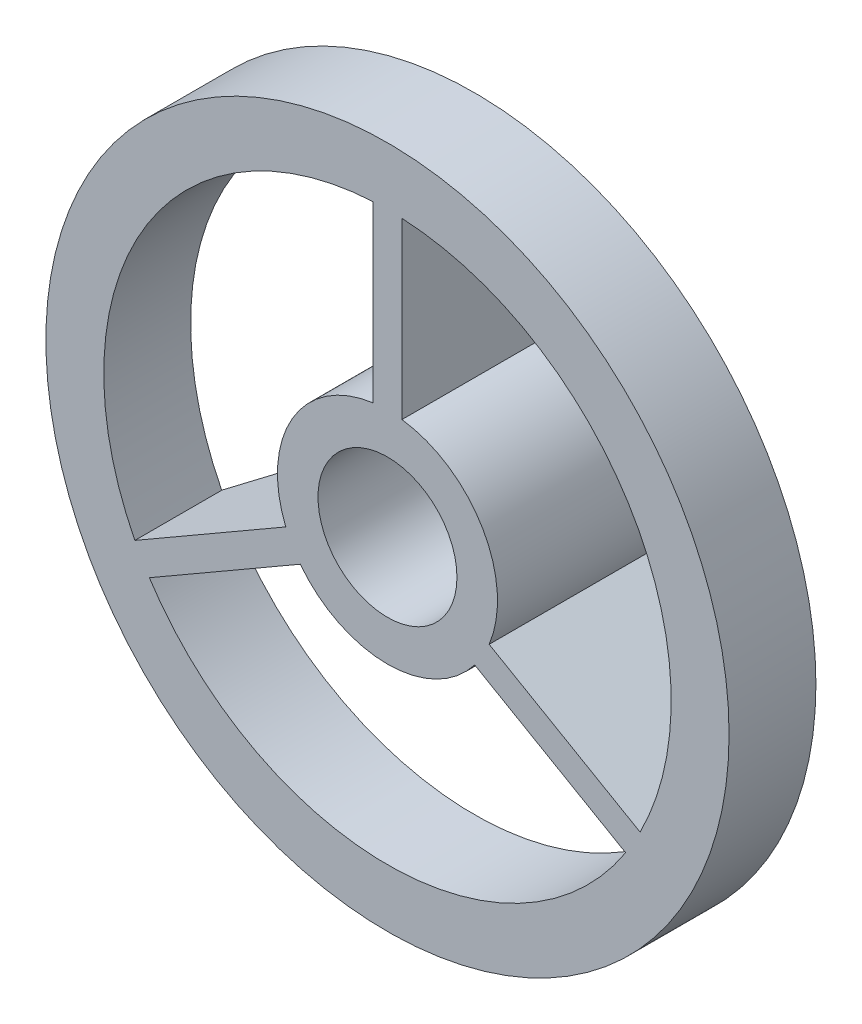
ISO-10303-21;
HEADER;
FILE_DESCRIPTION(('STEP AP214'),'2;1');
FILE_NAME('part.step','',(''),(''),'','','');
FILE_SCHEMA(('AUTOMOTIVE_DESIGN { 1 0 10303 214 1 1 1 1 }'));
ENDSEC;
DATA;
#1=APPLICATION_CONTEXT('core data for automotive mechanical design processes');
#2=APPLICATION_PROTOCOL_DEFINITION('international standard','automotive_design',2000,#1);
#3=PRODUCT_CONTEXT('',#1,'mechanical');
#4=PRODUCT('Part','Part','',(#3));
#5=PRODUCT_RELATED_PRODUCT_CATEGORY('part','',(#4));
#6=PRODUCT_DEFINITION_FORMATION('','',#4);
#7=PRODUCT_DEFINITION_CONTEXT('part definition',#1,'design');
#8=PRODUCT_DEFINITION('design','',#6,#7);
#9=PRODUCT_DEFINITION_SHAPE('','',#8);
#10=(LENGTH_UNIT() NAMED_UNIT(*) SI_UNIT(.MILLI.,.METRE.));
#11=(NAMED_UNIT(*) PLANE_ANGLE_UNIT() SI_UNIT($,.RADIAN.));
#12=(NAMED_UNIT(*) SI_UNIT($,.STERADIAN.) SOLID_ANGLE_UNIT());
#13=UNCERTAINTY_MEASURE_WITH_UNIT(LENGTH_MEASURE(1.E-05),#10,'distance_accuracy_value','');
#14=(GEOMETRIC_REPRESENTATION_CONTEXT(3) GLOBAL_UNCERTAINTY_ASSIGNED_CONTEXT((#13)) GLOBAL_UNIT_ASSIGNED_CONTEXT((#10,
#11,#12)) REPRESENTATION_CONTEXT('',''));
#15=CARTESIAN_POINT('',(0.,0.,0.));
#16=DIRECTION('',(0.,0.,1.));
#17=DIRECTION('',(1.,0.,0.));
#18=AXIS2_PLACEMENT_3D('',#15,#16,#17);
#19=CARTESIAN_POINT('',(0.,0.,3.5));
#20=DIRECTION('',(0.,0.,-1.));
#21=DIRECTION('',(-1.,0.,0.));
#22=AXIS2_PLACEMENT_3D('',#19,#20,#21);
#23=CYLINDRICAL_SURFACE('',#22,1.9);
#24=DIRECTION('',(0.,0.,-1.));
#25=VECTOR('',#24,1.);
#26=CARTESIAN_POINT('',(1.75614223781987,-0.725234059145742,3.5));
#27=LINE('',#26,#25);
#28=CARTESIAN_POINT('',(1.75614223781987,-0.725234059145742,0.));
#29=VERTEX_POINT('',#28);
#30=CARTESIAN_POINT('',(1.75614223781987,-0.725234059145742,3.5));
#31=VERTEX_POINT('',#30);
#32=EDGE_CURVE('E196',#29,#31,#27,.F.);
#33=ORIENTED_EDGE('',*,*,#32,.F.);
#34=CARTESIAN_POINT('',(0.,0.,0.));
#35=DIRECTION('',(0.,0.,1.));
#36=DIRECTION('',(1.,0.,0.));
#37=AXIS2_PLACEMENT_3D('',#34,#35,#36);
#38=CIRCLE('',#37,1.9);
#39=CARTESIAN_POINT('',(0.25,1.88348082018374,0.));
#40=VERTEX_POINT('',#39);
#41=EDGE_CURVE('E287',#29,#40,#38,.T.);
#42=ORIENTED_EDGE('',*,*,#41,.T.);
#43=DIRECTION('',(0.,0.,-1.));
#44=VECTOR('',#43,1.);
#45=CARTESIAN_POINT('',(0.25,1.88348082018374,3.5));
#46=LINE('',#45,#44);
#47=CARTESIAN_POINT('',(0.25,1.88348082018374,3.5));
#48=VERTEX_POINT('',#47);
#49=EDGE_CURVE('E301',#40,#48,#46,.F.);
#50=ORIENTED_EDGE('',*,*,#49,.T.);
#51=CARTESIAN_POINT('',(0.,0.,3.5));
#52=DIRECTION('',(0.,0.,1.));
#53=DIRECTION('',(1.,0.,0.));
#54=AXIS2_PLACEMENT_3D('',#51,#52,#53);
#55=CIRCLE('',#54,1.9);
#56=EDGE_CURVE('E295',#31,#48,#55,.T.);
#57=ORIENTED_EDGE('',*,*,#56,.F.);
#58=EDGE_LOOP('',(#33,#42,#50,#57));
#59=FACE_BOUND('',#58,.T.);
#60=ADVANCED_FACE('F35',(#59),#23,.T.);
#61=CARTESIAN_POINT('',(0.,0.,2.));
#62=DIRECTION('',(0.,0.,1.));
#63=DIRECTION('',(1.,0.,0.));
#64=AXIS2_PLACEMENT_3D('',#61,#62,#63);
#65=PLANE('',#64);
#66=CARTESIAN_POINT('',(0.,0.,2.));
#67=DIRECTION('',(0.,0.,1.));
#68=DIRECTION('',(1.,0.,0.));
#69=AXIS2_PLACEMENT_3D('',#66,#67,#68);
#70=CIRCLE('',#69,5.9);
#71=CARTESIAN_POINT('',(5.9,0.,2.));
#72=VERTEX_POINT('',#71);
#73=EDGE_CURVE('E247',#72,#72,#70,.T.);
#74=ORIENTED_EDGE('',*,*,#73,.F.);
#75=EDGE_LOOP('',(#74));
#76=FACE_BOUND('',#75,.T.);
#77=CARTESIAN_POINT('',(0.,0.,2.));
#78=DIRECTION('',(0.,0.,1.));
#79=DIRECTION('',(1.,0.,0.));
#80=AXIS2_PLACEMENT_3D('',#77,#78,#79);
#81=CIRCLE('',#80,4.9);
#82=CARTESIAN_POINT('',(-4.11299775837599,-2.66331549756954,2.));
#83=VERTEX_POINT('',#82);
#84=CARTESIAN_POINT('',(4.11299775837602,-2.66331549756949,2.));
#85=VERTEX_POINT('',#84);
#86=EDGE_CURVE('E242',#83,#85,#81,.T.);
#87=ORIENTED_EDGE('',*,*,#86,.T.);
#88=DIRECTION('',(0.866025403784443,-0.499999999999992,0.));
#89=VECTOR('',#88,1.);
#90=CARTESIAN_POINT('',(-0.124999999999998,-0.216506350946111,2.));
#91=LINE('',#90,#89);
#92=CARTESIAN_POINT('',(4.11852447854377,-2.66650635094607,2.));
#93=VERTEX_POINT('',#92);
#94=EDGE_CURVE('E201',#85,#93,#91,.T.);
#95=ORIENTED_EDGE('',*,*,#94,.T.);
#96=DIRECTION('',(0.499999999999992,0.866025403784443,0.));
#97=VECTOR('',#96,1.);
#98=CARTESIAN_POINT('',(4.11852447854377,-2.66650635094607,2.));
#99=LINE('',#98,#97);
#100=CARTESIAN_POINT('',(4.36852447854377,-2.23349364905385,2.));
#101=VERTEX_POINT('',#100);
#102=EDGE_CURVE('E50',#93,#101,#99,.T.);
#103=ORIENTED_EDGE('',*,*,#102,.T.);
#104=DIRECTION('',(0.866025403784443,-0.499999999999992,0.));
#105=VECTOR('',#104,1.);
#106=CARTESIAN_POINT('',(0.124999999999998,0.216506350946111,2.));
#107=LINE('',#106,#105);
#108=CARTESIAN_POINT('',(4.36299775837602,-2.23030279567726,2.));
#109=VERTEX_POINT('',#108);
#110=EDGE_CURVE('E194',#109,#101,#107,.T.);
#111=ORIENTED_EDGE('',*,*,#110,.F.);
#112=CARTESIAN_POINT('',(0.25,4.89361829324683,2.));
#113=VERTEX_POINT('',#112);
#114=EDGE_CURVE('E243',#109,#113,#81,.T.);
#115=ORIENTED_EDGE('',*,*,#114,.T.);
#116=DIRECTION('',(0.,-1.,0.));
#117=VECTOR('',#116,1.);
#118=CARTESIAN_POINT('',(0.25,0.,2.));
#119=LINE('',#118,#117);
#120=CARTESIAN_POINT('',(0.25,4.9,2.));
#121=VERTEX_POINT('',#120);
#122=EDGE_CURVE('E257',#121,#113,#119,.T.);
#123=ORIENTED_EDGE('',*,*,#122,.F.);
#124=DIRECTION('',(-1.,0.,0.));
#125=VECTOR('',#124,1.);
#126=CARTESIAN_POINT('',(0.25,4.9,2.));
#127=LINE('',#126,#125);
#128=CARTESIAN_POINT('',(-0.25,4.9,2.));
#129=VERTEX_POINT('',#128);
#130=EDGE_CURVE('E273',#121,#129,#127,.T.);
#131=ORIENTED_EDGE('',*,*,#130,.T.);
#132=DIRECTION('',(0.,-1.,0.));
#133=VECTOR('',#132,1.);
#134=CARTESIAN_POINT('',(-0.25,0.,2.));
#135=LINE('',#134,#133);
#136=CARTESIAN_POINT('',(-0.25,4.89361829324683,2.));
#137=VERTEX_POINT('',#136);
#138=EDGE_CURVE('E260',#129,#137,#135,.T.);
#139=ORIENTED_EDGE('',*,*,#138,.T.);
#140=CARTESIAN_POINT('',(-4.36299775837599,-2.23030279567732,2.));
#141=VERTEX_POINT('',#140);
#142=EDGE_CURVE('E238',#137,#141,#81,.T.);
#143=ORIENTED_EDGE('',*,*,#142,.T.);
#144=DIRECTION('',(-0.866025403784436,-0.500000000000004,0.));
#145=VECTOR('',#144,1.);
#146=CARTESIAN_POINT('',(-0.125000000000001,0.216506350946109,2.));
#147=LINE('',#146,#145);
#148=CARTESIAN_POINT('',(-4.36852447854374,-2.23349364905391,2.));
#149=VERTEX_POINT('',#148);
#150=EDGE_CURVE('E232',#141,#149,#147,.T.);
#151=ORIENTED_EDGE('',*,*,#150,.T.);
#152=DIRECTION('',(0.500000000000004,-0.866025403784436,0.));
#153=VECTOR('',#152,1.);
#154=CARTESIAN_POINT('',(-4.36852447854374,-2.23349364905391,2.));
#155=LINE('',#154,#153);
#156=CARTESIAN_POINT('',(-4.11852447854374,-2.66650635094613,2.));
#157=VERTEX_POINT('',#156);
#158=EDGE_CURVE('E215',#149,#157,#155,.T.);
#159=ORIENTED_EDGE('',*,*,#158,.T.);
#160=DIRECTION('',(-0.866025403784436,-0.500000000000004,0.));
#161=VECTOR('',#160,1.);
#162=CARTESIAN_POINT('',(0.125000000000001,-0.216506350946109,2.));
#163=LINE('',#162,#161);
#164=EDGE_CURVE('E226',#83,#157,#163,.T.);
#165=ORIENTED_EDGE('',*,*,#164,.F.);
#166=EDGE_LOOP('',(#87,#95,#103,#111,#115,#123,#131,#139,#143,#151,#159,#165));
#167=FACE_BOUND('',#166,.T.);
#168=ADVANCED_FACE('F331',(#76,#167),#65,.F.);
#169=CARTESIAN_POINT('',(0.,0.,2.));
#170=DIRECTION('',(0.,0.,1.));
#171=DIRECTION('',(1.,0.,0.));
#172=AXIS2_PLACEMENT_3D('',#169,#170,#171);
#173=CYLINDRICAL_SURFACE('',#172,4.9);
#174=DIRECTION('',(0.,0.,1.));
#175=VECTOR('',#174,1.);
#176=CARTESIAN_POINT('',(4.36299775837602,-2.23030279567726,2.));
#177=LINE('',#176,#175);
#178=CARTESIAN_POINT('',(4.36299775837602,-2.23030279567726,3.5));
#179=VERTEX_POINT('',#178);
#180=EDGE_CURVE('E169',#179,#109,#177,.F.);
#181=ORIENTED_EDGE('',*,*,#180,.F.);
#182=CARTESIAN_POINT('',(0.,0.,3.5));
#183=DIRECTION('',(0.,0.,1.));
#184=DIRECTION('',(1.,0.,0.));
#185=AXIS2_PLACEMENT_3D('',#182,#183,#184);
#186=CIRCLE('',#185,4.9);
#187=CARTESIAN_POINT('',(0.25,4.89361829324683,3.5));
#188=VERTEX_POINT('',#187);
#189=EDGE_CURVE('E237',#179,#188,#186,.T.);
#190=ORIENTED_EDGE('',*,*,#189,.T.);
#191=DIRECTION('',(0.,0.,1.));
#192=VECTOR('',#191,1.);
#193=CARTESIAN_POINT('',(0.25,4.89361829324683,2.));
#194=LINE('',#193,#192);
#195=EDGE_CURVE('E254',#113,#188,#194,.T.);
#196=ORIENTED_EDGE('',*,*,#195,.F.);
#197=ORIENTED_EDGE('',*,*,#114,.F.);
#198=EDGE_LOOP('',(#181,#190,#196,#197));
#199=FACE_BOUND('',#198,.T.);
#200=ADVANCED_FACE('F322',(#199),#173,.F.);
#201=CARTESIAN_POINT('',(-1.50614223781986,-1.15824676103798,0.));
#202=VERTEX_POINT('',#201);
#203=CARTESIAN_POINT('',(1.50614223781988,-1.15824676103796,0.));
#204=VERTEX_POINT('',#203);
#205=EDGE_CURVE('E298',#202,#204,#38,.T.);
#206=ORIENTED_EDGE('',*,*,#205,.T.);
#207=DIRECTION('',(0.,0.,-1.));
#208=VECTOR('',#207,1.);
#209=CARTESIAN_POINT('',(1.50614223781988,-1.15824676103796,3.5));
#210=LINE('',#209,#208);
#211=CARTESIAN_POINT('',(1.50614223781988,-1.15824676103796,3.5));
#212=VERTEX_POINT('',#211);
#213=EDGE_CURVE('E180',#204,#212,#210,.F.);
#214=ORIENTED_EDGE('',*,*,#213,.T.);
#215=CARTESIAN_POINT('',(-1.50614223781986,-1.15824676103799,3.5));
#216=VERTEX_POINT('',#215);
#217=EDGE_CURVE('E294',#216,#212,#55,.T.);
#218=ORIENTED_EDGE('',*,*,#217,.F.);
#219=DIRECTION('',(0.,0.,-1.));
#220=VECTOR('',#219,1.);
#221=CARTESIAN_POINT('',(-1.50614223781986,-1.15824676103798,3.5));
#222=LINE('',#221,#220);
#223=EDGE_CURVE('E229',#202,#216,#222,.F.);
#224=ORIENTED_EDGE('',*,*,#223,.F.);
#225=EDGE_LOOP('',(#206,#214,#218,#224));
#226=FACE_BOUND('',#225,.T.);
#227=ADVANCED_FACE('F335',(#226),#23,.T.);
#228=CARTESIAN_POINT('',(-4.11299775837599,-2.66331549756954,3.5));
#229=VERTEX_POINT('',#228);
#230=CARTESIAN_POINT('',(4.11299775837602,-2.66331549756949,3.5));
#231=VERTEX_POINT('',#230);
#232=EDGE_CURVE('E246',#229,#231,#186,.T.);
#233=ORIENTED_EDGE('',*,*,#232,.T.);
#234=DIRECTION('',(0.,0.,1.));
#235=VECTOR('',#234,1.);
#236=CARTESIAN_POINT('',(4.11299775837602,-2.66331549756949,2.));
#237=LINE('',#236,#235);
#238=EDGE_CURVE('E199',#231,#85,#237,.F.);
#239=ORIENTED_EDGE('',*,*,#238,.T.);
#240=ORIENTED_EDGE('',*,*,#86,.F.);
#241=DIRECTION('',(0.,0.,1.));
#242=VECTOR('',#241,1.);
#243=CARTESIAN_POINT('',(-4.11299775837599,-2.66331549756954,2.));
#244=LINE('',#243,#242);
#245=EDGE_CURVE('E43',#229,#83,#244,.F.);
#246=ORIENTED_EDGE('',*,*,#245,.F.);
#247=EDGE_LOOP('',(#233,#239,#240,#246));
#248=FACE_BOUND('',#247,.T.);
#249=ADVANCED_FACE('F311',(#248),#173,.F.);
#250=CARTESIAN_POINT('',(0.25,0.,0.));
#251=DIRECTION('',(1.,0.,0.));
#252=DIRECTION('',(0.,0.,-1.));
#253=AXIS2_PLACEMENT_3D('',#250,#251,#252);
#254=PLANE('',#253);
#255=DIRECTION('',(0.,0.832050294337844,0.554700196225229));
#256=VECTOR('',#255,1.);
#257=CARTESIAN_POINT('',(0.25,0.584615384615385,-0.876923076923077));
#258=LINE('',#257,#256);
#259=CARTESIAN_POINT('',(0.25,1.9,0.));
#260=VERTEX_POINT('',#259);
#261=EDGE_CURVE('E270',#260,#121,#258,.T.);
#262=ORIENTED_EDGE('',*,*,#261,.T.);
#263=ORIENTED_EDGE('',*,*,#122,.T.);
#264=ORIENTED_EDGE('',*,*,#195,.T.);
#265=DIRECTION('',(0.,-1.,0.));
#266=VECTOR('',#265,1.);
#267=CARTESIAN_POINT('',(0.25,0.,3.5));
#268=LINE('',#267,#266);
#269=EDGE_CURVE('E263',#188,#48,#268,.T.);
#270=ORIENTED_EDGE('',*,*,#269,.T.);
#271=ORIENTED_EDGE('',*,*,#49,.F.);
#272=DIRECTION('',(0.,-1.,0.));
#273=VECTOR('',#272,1.);
#274=CARTESIAN_POINT('',(0.25,0.,0.));
#275=LINE('',#274,#273);
#276=EDGE_CURVE('E266',#260,#40,#275,.T.);
#277=ORIENTED_EDGE('',*,*,#276,.F.);
#278=EDGE_LOOP('',(#262,#263,#264,#270,#271,#277));
#279=FACE_BOUND('',#278,.T.);
#280=ADVANCED_FACE('F327',(#279),#254,.T.);
#281=CARTESIAN_POINT('',(-0.25,0.,0.));
#282=DIRECTION('',(1.,0.,0.));
#283=DIRECTION('',(0.,0.,-1.));
#284=AXIS2_PLACEMENT_3D('',#281,#282,#283);
#285=PLANE('',#284);
#286=ORIENTED_EDGE('',*,*,#138,.F.);
#287=DIRECTION('',(0.,0.832050294337844,0.554700196225229));
#288=VECTOR('',#287,1.);
#289=CARTESIAN_POINT('',(-0.25,0.584615384615385,-0.876923076923077));
#290=LINE('',#289,#288);
#291=CARTESIAN_POINT('',(-0.25,1.9,0.));
#292=VERTEX_POINT('',#291);
#293=EDGE_CURVE('E267',#292,#129,#290,.T.);
#294=ORIENTED_EDGE('',*,*,#293,.F.);
#295=DIRECTION('',(0.,-1.,0.));
#296=VECTOR('',#295,1.);
#297=CARTESIAN_POINT('',(-0.25,0.,0.));
#298=LINE('',#297,#296);
#299=CARTESIAN_POINT('',(-0.25,1.88348082018374,0.));
#300=VERTEX_POINT('',#299);
#301=EDGE_CURVE('E275',#292,#300,#298,.T.);
#302=ORIENTED_EDGE('',*,*,#301,.T.);
#303=DIRECTION('',(0.,0.,-1.));
#304=VECTOR('',#303,1.);
#305=CARTESIAN_POINT('',(-0.25,1.88348082018374,3.5));
#306=LINE('',#305,#304);
#307=CARTESIAN_POINT('',(-0.25,1.88348082018374,3.5));
#308=VERTEX_POINT('',#307);
#309=EDGE_CURVE('E293',#300,#308,#306,.F.);
#310=ORIENTED_EDGE('',*,*,#309,.T.);
#311=DIRECTION('',(0.,-1.,0.));
#312=VECTOR('',#311,1.);
#313=CARTESIAN_POINT('',(-0.25,0.,3.5));
#314=LINE('',#313,#312);
#315=CARTESIAN_POINT('',(-0.25,4.89361829324683,3.5));
#316=VERTEX_POINT('',#315);
#317=EDGE_CURVE('E262',#316,#308,#314,.T.);
#318=ORIENTED_EDGE('',*,*,#317,.F.);
#319=DIRECTION('',(0.,0.,1.));
#320=VECTOR('',#319,1.);
#321=CARTESIAN_POINT('',(-0.25,4.89361829324683,2.));
#322=LINE('',#321,#320);
#323=EDGE_CURVE('E250',#137,#316,#322,.T.);
#324=ORIENTED_EDGE('',*,*,#323,.F.);
#325=EDGE_LOOP('',(#286,#294,#302,#310,#318,#324));
#326=FACE_BOUND('',#325,.T.);
#327=ADVANCED_FACE('F357',(#326),#285,.F.);
#328=CARTESIAN_POINT('',(0.,0.,3.5));
#329=DIRECTION('',(0.,0.,1.));
#330=DIRECTION('',(1.,0.,0.));
#331=AXIS2_PLACEMENT_3D('',#328,#329,#330);
#332=PLANE('',#331);
#333=DIRECTION('',(-0.866025403784443,0.499999999999992,0.));
#334=VECTOR('',#333,1.);
#335=CARTESIAN_POINT('',(0.124999999999998,0.216506350946111,3.5));
#336=LINE('',#335,#334);
#337=EDGE_CURVE('E186',#179,#31,#336,.T.);
#338=ORIENTED_EDGE('',*,*,#337,.T.);
#339=ORIENTED_EDGE('',*,*,#56,.T.);
#340=ORIENTED_EDGE('',*,*,#269,.F.);
#341=ORIENTED_EDGE('',*,*,#189,.F.);
#342=EDGE_LOOP('',(#338,#339,#340,#341));
#343=FACE_BOUND('',#342,.T.);
#344=ORIENTED_EDGE('',*,*,#217,.T.);
#345=DIRECTION('',(-0.866025403784443,0.499999999999992,0.));
#346=VECTOR('',#345,1.);
#347=CARTESIAN_POINT('',(-0.124999999999998,-0.216506350946111,3.5));
#348=LINE('',#347,#346);
#349=EDGE_CURVE('E181',#231,#212,#348,.T.);
#350=ORIENTED_EDGE('',*,*,#349,.F.);
#351=ORIENTED_EDGE('',*,*,#232,.F.);
#352=DIRECTION('',(0.866025403784436,0.500000000000004,0.));
#353=VECTOR('',#352,1.);
#354=CARTESIAN_POINT('',(0.125000000000001,-0.216506350946109,3.5));
#355=LINE('',#354,#353);
#356=EDGE_CURVE('E204',#229,#216,#355,.T.);
#357=ORIENTED_EDGE('',*,*,#356,.T.);
#358=EDGE_LOOP('',(#344,#350,#351,#357));
#359=FACE_BOUND('',#358,.T.);
#360=CARTESIAN_POINT('',(-1.75614223781986,-0.725234059145766,3.5));
#361=VERTEX_POINT('',#360);
#362=EDGE_CURVE('E290',#308,#361,#55,.T.);
#363=ORIENTED_EDGE('',*,*,#362,.T.);
#364=DIRECTION('',(0.866025403784436,0.500000000000004,0.));
#365=VECTOR('',#364,1.);
#366=CARTESIAN_POINT('',(-0.125000000000001,0.216506350946109,3.5));
#367=LINE('',#366,#365);
#368=CARTESIAN_POINT('',(-4.36299775837599,-2.23030279567732,3.5));
#369=VERTEX_POINT('',#368);
#370=EDGE_CURVE('E205',#369,#361,#367,.T.);
#371=ORIENTED_EDGE('',*,*,#370,.F.);
#372=EDGE_CURVE('E244',#316,#369,#186,.T.);
#373=ORIENTED_EDGE('',*,*,#372,.F.);
#374=ORIENTED_EDGE('',*,*,#317,.T.);
#375=EDGE_LOOP('',(#363,#371,#373,#374));
#376=FACE_BOUND('',#375,.T.);
#377=CARTESIAN_POINT('',(0.,0.,3.5));
#378=DIRECTION('',(0.,0.,1.));
#379=DIRECTION('',(1.,0.,0.));
#380=AXIS2_PLACEMENT_3D('',#377,#378,#379);
#381=CIRCLE('',#380,5.9);
#382=CARTESIAN_POINT('',(5.9,0.,3.5));
#383=VERTEX_POINT('',#382);
#384=EDGE_CURVE('E241',#383,#383,#381,.T.);
#385=ORIENTED_EDGE('',*,*,#384,.T.);
#386=EDGE_LOOP('',(#385));
#387=FACE_BOUND('',#386,.T.);
#388=CARTESIAN_POINT('',(0.,0.,3.5));
#389=DIRECTION('',(0.,0.,1.));
#390=DIRECTION('',(1.,0.,0.));
#391=AXIS2_PLACEMENT_3D('',#388,#389,#390);
#392=CIRCLE('',#391,1.2);
#393=CARTESIAN_POINT('',(1.2,0.,3.5));
#394=VERTEX_POINT('',#393);
#395=EDGE_CURVE('E284',#394,#394,#392,.T.);
#396=ORIENTED_EDGE('',*,*,#395,.F.);
#397=EDGE_LOOP('',(#396));
#398=FACE_BOUND('',#397,.T.);
#399=ADVANCED_FACE('F317',(#343,#359,#376,#387,#398),#332,.T.);
#400=CARTESIAN_POINT('',(0.,0.,0.));
#401=DIRECTION('',(0.,0.,1.));
#402=DIRECTION('',(1.,0.,0.));
#403=AXIS2_PLACEMENT_3D('',#400,#401,#402);
#404=PLANE('',#403);
#405=ORIENTED_EDGE('',*,*,#41,.F.);
#406=DIRECTION('',(-0.866025403784443,0.499999999999992,0.));
#407=VECTOR('',#406,1.);
#408=CARTESIAN_POINT('',(0.124999999999998,0.216506350946111,0.));
#409=LINE('',#408,#407);
#410=CARTESIAN_POINT('',(1.77044826719044,-0.733493649053874,0.));
#411=VERTEX_POINT('',#410);
#412=EDGE_CURVE('E167',#411,#29,#409,.T.);
#413=ORIENTED_EDGE('',*,*,#412,.F.);
#414=DIRECTION('',(0.499999999999992,0.866025403784443,0.));
#415=VECTOR('',#414,1.);
#416=CARTESIAN_POINT('',(1.52044826719044,-1.1665063509461,0.));
#417=LINE('',#416,#415);
#418=CARTESIAN_POINT('',(1.52044826719044,-1.1665063509461,0.));
#419=VERTEX_POINT('',#418);
#420=EDGE_CURVE('E159',#419,#411,#417,.T.);
#421=ORIENTED_EDGE('',*,*,#420,.F.);
#422=DIRECTION('',(-0.866025403784443,0.499999999999992,0.));
#423=VECTOR('',#422,1.);
#424=CARTESIAN_POINT('',(-0.124999999999998,-0.216506350946111,0.));
#425=LINE('',#424,#423);
#426=EDGE_CURVE('E165',#419,#204,#425,.T.);
#427=ORIENTED_EDGE('',*,*,#426,.T.);
#428=ORIENTED_EDGE('',*,*,#205,.F.);
#429=DIRECTION('',(0.866025403784436,0.500000000000004,0.));
#430=VECTOR('',#429,1.);
#431=CARTESIAN_POINT('',(0.125000000000001,-0.216506350946109,0.));
#432=LINE('',#431,#430);
#433=CARTESIAN_POINT('',(-1.52044826719043,-1.16650635094612,0.));
#434=VERTEX_POINT('',#433);
#435=EDGE_CURVE('E218',#434,#202,#432,.T.);
#436=ORIENTED_EDGE('',*,*,#435,.F.);
#437=DIRECTION('',(0.500000000000004,-0.866025403784436,0.));
#438=VECTOR('',#437,1.);
#439=CARTESIAN_POINT('',(-1.77044826719043,-0.733493649053898,0.));
#440=LINE('',#439,#438);
#441=CARTESIAN_POINT('',(-1.77044826719043,-0.733493649053898,0.));
#442=VERTEX_POINT('',#441);
#443=EDGE_CURVE('E224',#442,#434,#440,.T.);
#444=ORIENTED_EDGE('',*,*,#443,.F.);
#445=DIRECTION('',(0.866025403784436,0.500000000000004,0.));
#446=VECTOR('',#445,1.);
#447=CARTESIAN_POINT('',(-0.125000000000001,0.216506350946109,0.));
#448=LINE('',#447,#446);
#449=CARTESIAN_POINT('',(-1.75614223781986,-0.725234059145766,0.));
#450=VERTEX_POINT('',#449);
#451=EDGE_CURVE('E208',#442,#450,#448,.T.);
#452=ORIENTED_EDGE('',*,*,#451,.T.);
#453=EDGE_CURVE('E296',#300,#450,#38,.T.);
#454=ORIENTED_EDGE('',*,*,#453,.F.);
#455=ORIENTED_EDGE('',*,*,#301,.F.);
#456=DIRECTION('',(-1.,0.,0.));
#457=VECTOR('',#456,1.);
#458=CARTESIAN_POINT('',(0.25,1.9,0.));
#459=LINE('',#458,#457);
#460=EDGE_CURVE('E281',#260,#292,#459,.T.);
#461=ORIENTED_EDGE('',*,*,#460,.F.);
#462=ORIENTED_EDGE('',*,*,#276,.T.);
#463=EDGE_LOOP('',(#405,#413,#421,#427,#428,#436,#444,#452,#454,#455,#461,#462));
#464=FACE_BOUND('',#463,.T.);
#465=CARTESIAN_POINT('',(0.,0.,0.));
#466=DIRECTION('',(0.,0.,1.));
#467=DIRECTION('',(1.,0.,0.));
#468=AXIS2_PLACEMENT_3D('',#465,#466,#467);
#469=CIRCLE('',#468,1.2);
#470=CARTESIAN_POINT('',(1.2,0.,0.));
#471=VERTEX_POINT('',#470);
#472=EDGE_CURVE('E283',#471,#471,#469,.T.);
#473=ORIENTED_EDGE('',*,*,#472,.T.);
#474=EDGE_LOOP('',(#473));
#475=FACE_BOUND('',#474,.T.);
#476=ADVANCED_FACE('F161',(#464,#475),#404,.F.);
#477=ORIENTED_EDGE('',*,*,#453,.T.);
#478=DIRECTION('',(0.,0.,-1.));
#479=VECTOR('',#478,1.);
#480=CARTESIAN_POINT('',(-1.75614223781986,-0.725234059145767,3.5));
#481=LINE('',#480,#479);
#482=EDGE_CURVE('E235',#450,#361,#481,.F.);
#483=ORIENTED_EDGE('',*,*,#482,.T.);
#484=ORIENTED_EDGE('',*,*,#362,.F.);
#485=ORIENTED_EDGE('',*,*,#309,.F.);
#486=EDGE_LOOP('',(#477,#483,#484,#485));
#487=FACE_BOUND('',#486,.T.);
#488=ADVANCED_FACE('F37',(#487),#23,.T.);
#489=CARTESIAN_POINT('',(0.,0.,3.5));
#490=DIRECTION('',(0.,0.,-1.));
#491=DIRECTION('',(-1.,0.,0.));
#492=AXIS2_PLACEMENT_3D('',#489,#490,#491);
#493=CYLINDRICAL_SURFACE('',#492,1.2);
#494=ORIENTED_EDGE('',*,*,#395,.T.);
#495=EDGE_LOOP('',(#494));
#496=FACE_BOUND('',#495,.T.);
#497=ORIENTED_EDGE('',*,*,#472,.F.);
#498=EDGE_LOOP('',(#497));
#499=FACE_BOUND('',#498,.T.);
#500=ADVANCED_FACE('F375',(#496,#499),#493,.F.);
#501=CARTESIAN_POINT('',(0.25,0.584615384615385,-0.876923076923077));
#502=DIRECTION('',(0.,-0.554700196225229,0.832050294337844));
#503=DIRECTION('',(0.,-0.832050294337844,-0.554700196225229));
#504=AXIS2_PLACEMENT_3D('',#501,#502,#503);
#505=PLANE('',#504);
#506=ORIENTED_EDGE('',*,*,#293,.T.);
#507=ORIENTED_EDGE('',*,*,#130,.F.);
#508=ORIENTED_EDGE('',*,*,#261,.F.);
#509=ORIENTED_EDGE('',*,*,#460,.T.);
#510=EDGE_LOOP('',(#506,#507,#508,#509));
#511=FACE_BOUND('',#510,.T.);
#512=ADVANCED_FACE('F362',(#511),#505,.F.);
#513=ORIENTED_EDGE('',*,*,#372,.T.);
#514=DIRECTION('',(0.,0.,1.));
#515=VECTOR('',#514,1.);
#516=CARTESIAN_POINT('',(-4.36299775837599,-2.23030279567732,2.));
#517=LINE('',#516,#515);
#518=EDGE_CURVE('E11',#369,#141,#517,.F.);
#519=ORIENTED_EDGE('',*,*,#518,.T.);
#520=ORIENTED_EDGE('',*,*,#142,.F.);
#521=ORIENTED_EDGE('',*,*,#323,.T.);
#522=EDGE_LOOP('',(#513,#519,#520,#521));
#523=FACE_BOUND('',#522,.T.);
#524=ADVANCED_FACE('F365',(#523),#173,.F.);
#525=CARTESIAN_POINT('',(0.,0.,2.));
#526=DIRECTION('',(0.,0.,1.));
#527=DIRECTION('',(1.,0.,0.));
#528=AXIS2_PLACEMENT_3D('',#525,#526,#527);
#529=CYLINDRICAL_SURFACE('',#528,5.9);
#530=ORIENTED_EDGE('',*,*,#73,.T.);
#531=EDGE_LOOP('',(#530));
#532=FACE_BOUND('',#531,.T.);
#533=ORIENTED_EDGE('',*,*,#384,.F.);
#534=EDGE_LOOP('',(#533));
#535=FACE_BOUND('',#534,.T.);
#536=ADVANCED_FACE('F367',(#532,#535),#529,.T.);
#537=CARTESIAN_POINT('',(-0.125000000000001,0.216506350946109,0.));
#538=DIRECTION('',(-0.500000000000004,0.866025403784436,0.));
#539=DIRECTION('',(0.,0.,-1.));
#540=AXIS2_PLACEMENT_3D('',#537,#538,#539);
#541=PLANE('',#540);
#542=ORIENTED_EDGE('',*,*,#482,.F.);
#543=ORIENTED_EDGE('',*,*,#451,.F.);
#544=DIRECTION('',(-0.72057669212289,-0.416025147168925,0.554700196225229));
#545=VECTOR('',#544,1.);
#546=CARTESIAN_POINT('',(-0.631291774520133,-0.0758013413615856,-0.876923076923077));
#547=LINE('',#546,#545);
#548=EDGE_CURVE('E212',#442,#149,#547,.T.);
#549=ORIENTED_EDGE('',*,*,#548,.T.);
#550=ORIENTED_EDGE('',*,*,#150,.F.);
#551=ORIENTED_EDGE('',*,*,#518,.F.);
#552=ORIENTED_EDGE('',*,*,#370,.T.);
#553=EDGE_LOOP('',(#542,#543,#549,#550,#551,#552));
#554=FACE_BOUND('',#553,.T.);
#555=ADVANCED_FACE('F345',(#554),#541,.T.);
#556=CARTESIAN_POINT('',(0.125000000000001,-0.216506350946109,0.));
#557=DIRECTION('',(-0.500000000000004,0.866025403784436,0.));
#558=DIRECTION('',(0.,0.,-1.));
#559=AXIS2_PLACEMENT_3D('',#556,#557,#558);
#560=PLANE('',#559);
#561=ORIENTED_EDGE('',*,*,#435,.T.);
#562=ORIENTED_EDGE('',*,*,#223,.T.);
#563=ORIENTED_EDGE('',*,*,#356,.F.);
#564=ORIENTED_EDGE('',*,*,#245,.T.);
#565=ORIENTED_EDGE('',*,*,#164,.T.);
#566=DIRECTION('',(-0.72057669212289,-0.416025147168925,0.554700196225229));
#567=VECTOR('',#566,1.);
#568=CARTESIAN_POINT('',(-0.381291774520131,-0.508814043253804,-0.876923076923077));
#569=LINE('',#568,#567);
#570=EDGE_CURVE('E209',#434,#157,#569,.T.);
#571=ORIENTED_EDGE('',*,*,#570,.F.);
#572=EDGE_LOOP('',(#561,#562,#563,#564,#565,#571));
#573=FACE_BOUND('',#572,.T.);
#574=ADVANCED_FACE('F306',(#573),#560,.F.);
#575=CARTESIAN_POINT('',(-0.631291774520133,-0.0758013413615856,-0.876923076923077));
#576=DIRECTION('',(0.48038446141526,0.277350098112617,0.832050294337844));
#577=DIRECTION('',(0.866025403784439,0.,-0.499999999999999));
#578=AXIS2_PLACEMENT_3D('',#575,#576,#577);
#579=PLANE('',#578);
#580=ORIENTED_EDGE('',*,*,#570,.T.);
#581=ORIENTED_EDGE('',*,*,#158,.F.);
#582=ORIENTED_EDGE('',*,*,#548,.F.);
#583=ORIENTED_EDGE('',*,*,#443,.T.);
#584=EDGE_LOOP('',(#580,#581,#582,#583));
#585=FACE_BOUND('',#584,.T.);
#586=ADVANCED_FACE('F338',(#585),#579,.F.);
#587=CARTESIAN_POINT('',(-0.124999999999998,-0.216506350946111,0.));
#588=DIRECTION('',(-0.499999999999992,-0.866025403784443,0.));
#589=DIRECTION('',(0.,0.,-1.));
#590=AXIS2_PLACEMENT_3D('',#587,#588,#589);
#591=PLANE('',#590);
#592=ORIENTED_EDGE('',*,*,#213,.F.);
#593=ORIENTED_EDGE('',*,*,#426,.F.);
#594=DIRECTION('',(0.720576692122896,-0.416025147168915,0.554700196225229));
#595=VECTOR('',#594,1.);
#596=CARTESIAN_POINT('',(0.381291774520138,-0.508814043253798,-0.876923076923077));
#597=LINE('',#596,#595);
#598=EDGE_CURVE('E172',#419,#93,#597,.T.);
#599=ORIENTED_EDGE('',*,*,#598,.T.);
#600=ORIENTED_EDGE('',*,*,#94,.F.);
#601=ORIENTED_EDGE('',*,*,#238,.F.);
#602=ORIENTED_EDGE('',*,*,#349,.T.);
#603=EDGE_LOOP('',(#592,#593,#599,#600,#601,#602));
#604=FACE_BOUND('',#603,.T.);
#605=ADVANCED_FACE('F178',(#604),#591,.T.);
#606=CARTESIAN_POINT('',(0.124999999999998,0.216506350946111,0.));
#607=DIRECTION('',(-0.499999999999992,-0.866025403784443,0.));
#608=DIRECTION('',(0.,0.,-1.));
#609=AXIS2_PLACEMENT_3D('',#606,#607,#608);
#610=PLANE('',#609);
#611=ORIENTED_EDGE('',*,*,#412,.T.);
#612=ORIENTED_EDGE('',*,*,#32,.T.);
#613=ORIENTED_EDGE('',*,*,#337,.F.);
#614=ORIENTED_EDGE('',*,*,#180,.T.);
#615=ORIENTED_EDGE('',*,*,#110,.T.);
#616=DIRECTION('',(0.720576692122896,-0.416025147168915,0.554700196225229));
#617=VECTOR('',#616,1.);
#618=CARTESIAN_POINT('',(0.631291774520134,-0.0758013413615768,-0.876923076923077));
#619=LINE('',#618,#617);
#620=EDGE_CURVE('E183',#411,#101,#619,.T.);
#621=ORIENTED_EDGE('',*,*,#620,.F.);
#622=EDGE_LOOP('',(#611,#612,#613,#614,#615,#621));
#623=FACE_BOUND('',#622,.T.);
#624=ADVANCED_FACE('F333',(#623),#610,.F.);
#625=CARTESIAN_POINT('',(0.381291774520138,-0.508814043253798,-0.876923076923077));
#626=DIRECTION('',(-0.480384461415264,0.27735009811261,0.832050294337844));
#627=DIRECTION('',(0.866025403784437,0.,0.500000000000002));
#628=AXIS2_PLACEMENT_3D('',#625,#626,#627);
#629=PLANE('',#628);
#630=ORIENTED_EDGE('',*,*,#620,.T.);
#631=ORIENTED_EDGE('',*,*,#102,.F.);
#632=ORIENTED_EDGE('',*,*,#598,.F.);
#633=ORIENTED_EDGE('',*,*,#420,.T.);
#634=EDGE_LOOP('',(#630,#631,#632,#633));
#635=FACE_BOUND('',#634,.T.);
#636=ADVANCED_FACE('F173',(#635),#629,.F.);
#637=CLOSED_SHELL('',(#60,#168,#200,#227,#249,#280,#327,#399,#476,#488,#500,#512,#524,#536,#555,
#574,#586,#605,#624,#636));
#638=MANIFOLD_SOLID_BREP('B2',#637);
#639=ADVANCED_BREP_SHAPE_REPRESENTATION('',(#18,#638),#14);
#640=SHAPE_DEFINITION_REPRESENTATION(#9,#639);
ENDSEC;
END-ISO-10303-21;
